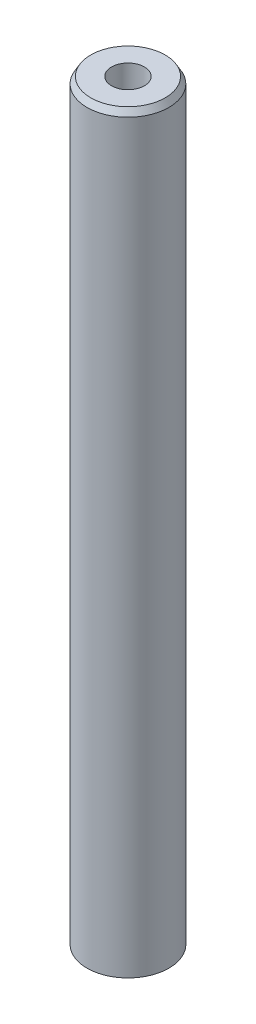
ISO-10303-21;
HEADER;
FILE_DESCRIPTION(('STEP AP214'),'2;1');
FILE_NAME('part.step','',(''),(''),'','','');
FILE_SCHEMA(('AUTOMOTIVE_DESIGN { 1 0 10303 214 1 1 1 1 }'));
ENDSEC;
DATA;
#1=APPLICATION_CONTEXT('core data for automotive mechanical design processes');
#2=APPLICATION_PROTOCOL_DEFINITION('international standard','automotive_design',2000,#1);
#3=PRODUCT_CONTEXT('',#1,'mechanical');
#4=PRODUCT('Part','Part','',(#3));
#5=PRODUCT_RELATED_PRODUCT_CATEGORY('part','',(#4));
#6=PRODUCT_DEFINITION_FORMATION('','',#4);
#7=PRODUCT_DEFINITION_CONTEXT('part definition',#1,'design');
#8=PRODUCT_DEFINITION('design','',#6,#7);
#9=PRODUCT_DEFINITION_SHAPE('','',#8);
#10=(LENGTH_UNIT() NAMED_UNIT(*) SI_UNIT(.MILLI.,.METRE.));
#11=(NAMED_UNIT(*) PLANE_ANGLE_UNIT() SI_UNIT($,.RADIAN.));
#12=(NAMED_UNIT(*) SI_UNIT($,.STERADIAN.) SOLID_ANGLE_UNIT());
#13=UNCERTAINTY_MEASURE_WITH_UNIT(LENGTH_MEASURE(1.E-05),#10,'distance_accuracy_value','');
#14=(GEOMETRIC_REPRESENTATION_CONTEXT(3) GLOBAL_UNCERTAINTY_ASSIGNED_CONTEXT((#13)) GLOBAL_UNIT_ASSIGNED_CONTEXT((#10,
#11,#12)) REPRESENTATION_CONTEXT('',''));
#15=CARTESIAN_POINT('',(0.,0.,0.));
#16=DIRECTION('',(0.,0.,1.));
#17=DIRECTION('',(1.,0.,0.));
#18=AXIS2_PLACEMENT_3D('',#15,#16,#17);
#19=CARTESIAN_POINT('',(0.,600.,0.));
#20=DIRECTION('',(0.,-1.,0.));
#21=DIRECTION('',(0.,0.,-1.));
#22=AXIS2_PLACEMENT_3D('',#19,#20,#21);
#23=CYLINDRICAL_SURFACE('',#22,32.5);
#24=CARTESIAN_POINT('',(0.,594.861538662219,0.));
#25=DIRECTION('',(0.,1.,0.));
#26=DIRECTION('',(0.,0.,1.));
#27=AXIS2_PLACEMENT_3D('',#24,#25,#26);
#28=CIRCLE('',#27,32.5);
#29=CARTESIAN_POINT('',(0.,594.861538662219,32.5));
#30=VERTEX_POINT('',#29);
#31=EDGE_CURVE('E50',#30,#30,#28,.F.);
#32=ORIENTED_EDGE('',*,*,#31,.T.);
#33=EDGE_LOOP('',(#32));
#34=FACE_BOUND('',#33,.T.);
#35=CARTESIAN_POINT('',(0.,2.96669203658828,0.));
#36=DIRECTION('',(0.,1.,0.));
#37=DIRECTION('',(0.,0.,1.));
#38=AXIS2_PLACEMENT_3D('',#35,#36,#37);
#39=CIRCLE('',#38,32.5);
#40=CARTESIAN_POINT('',(0.,2.96669203658828,32.5));
#41=VERTEX_POINT('',#40);
#42=EDGE_CURVE('E51',#41,#41,#39,.T.);
#43=ORIENTED_EDGE('',*,*,#42,.T.);
#44=EDGE_LOOP('',(#43));
#45=FACE_BOUND('',#44,.T.);
#46=ADVANCED_FACE('F39',(#34,#45),#23,.T.);
#47=CARTESIAN_POINT('',(0.,600.,0.));
#48=DIRECTION('',(0.,1.,0.));
#49=DIRECTION('',(0.,0.,1.));
#50=AXIS2_PLACEMENT_3D('',#47,#48,#49);
#51=PLANE('',#50);
#52=CARTESIAN_POINT('',(0.,600.,0.));
#53=DIRECTION('',(0.,1.,0.));
#54=DIRECTION('',(0.,0.,1.));
#55=AXIS2_PLACEMENT_3D('',#52,#53,#54);
#56=CIRCLE('',#55,29.5333079634116);
#57=CARTESIAN_POINT('',(0.,600.,29.5333079634116));
#58=VERTEX_POINT('',#57);
#59=EDGE_CURVE('E54',#58,#58,#56,.T.);
#60=ORIENTED_EDGE('',*,*,#59,.T.);
#61=EDGE_LOOP('',(#60));
#62=FACE_BOUND('',#61,.T.);
#63=CARTESIAN_POINT('',(0.,600.,0.));
#64=DIRECTION('',(0.,1.,0.));
#65=DIRECTION('',(0.,0.,1.));
#66=AXIS2_PLACEMENT_3D('',#63,#64,#65);
#67=CIRCLE('',#66,13.0247860554723);
#68=CARTESIAN_POINT('',(0.,600.,13.0247860554723));
#69=VERTEX_POINT('',#68);
#70=EDGE_CURVE('E58',#69,#69,#67,.T.);
#71=ORIENTED_EDGE('',*,*,#70,.F.);
#72=EDGE_LOOP('',(#71));
#73=FACE_BOUND('',#72,.T.);
#74=ADVANCED_FACE('F69',(#62,#73),#51,.T.);
#75=CARTESIAN_POINT('',(0.,0.,0.));
#76=DIRECTION('',(0.,1.,0.));
#77=DIRECTION('',(0.,0.,1.));
#78=AXIS2_PLACEMENT_3D('',#75,#76,#77);
#79=PLANE('',#78);
#80=CARTESIAN_POINT('',(0.,0.,0.));
#81=DIRECTION('',(0.,1.,0.));
#82=DIRECTION('',(0.,0.,1.));
#83=AXIS2_PLACEMENT_3D('',#80,#81,#82);
#84=CIRCLE('',#83,27.361538662219);
#85=CARTESIAN_POINT('',(0.,0.,27.361538662219));
#86=VERTEX_POINT('',#85);
#87=EDGE_CURVE('E10',#86,#86,#84,.F.);
#88=ORIENTED_EDGE('',*,*,#87,.T.);
#89=EDGE_LOOP('',(#88));
#90=FACE_BOUND('',#89,.T.);
#91=CARTESIAN_POINT('',(0.,0.,0.));
#92=DIRECTION('',(0.,1.,0.));
#93=DIRECTION('',(0.,0.,1.));
#94=AXIS2_PLACEMENT_3D('',#91,#92,#93);
#95=CIRCLE('',#94,13.0247860554723);
#96=CARTESIAN_POINT('',(0.,0.,13.0247860554723));
#97=VERTEX_POINT('',#96);
#98=EDGE_CURVE('E63',#97,#97,#95,.T.);
#99=ORIENTED_EDGE('',*,*,#98,.T.);
#100=EDGE_LOOP('',(#99));
#101=FACE_BOUND('',#100,.T.);
#102=ADVANCED_FACE('F75',(#90,#101),#79,.F.);
#103=CARTESIAN_POINT('',(0.,600.,0.));
#104=DIRECTION('',(0.,-1.,0.));
#105=DIRECTION('',(0.,0.,-1.));
#106=AXIS2_PLACEMENT_3D('',#103,#104,#105);
#107=CYLINDRICAL_SURFACE('',#106,13.0247860554723);
#108=ORIENTED_EDGE('',*,*,#70,.T.);
#109=EDGE_LOOP('',(#108));
#110=FACE_BOUND('',#109,.T.);
#111=ORIENTED_EDGE('',*,*,#98,.F.);
#112=EDGE_LOOP('',(#111));
#113=FACE_BOUND('',#112,.T.);
#114=ADVANCED_FACE('F70',(#110,#113),#107,.F.);
#115=CARTESIAN_POINT('',(0.,600.,0.));
#116=DIRECTION('',(0.,-1.,0.));
#117=DIRECTION('',(0.,0.,-1.));
#118=AXIS2_PLACEMENT_3D('',#115,#116,#117);
#119=CONICAL_SURFACE('',#118,29.5333079634116,0.523598775598296);
#120=ORIENTED_EDGE('',*,*,#31,.F.);
#121=EDGE_LOOP('',(#120));
#122=FACE_BOUND('',#121,.T.);
#123=ORIENTED_EDGE('',*,*,#59,.F.);
#124=EDGE_LOOP('',(#123));
#125=FACE_BOUND('',#124,.T.);
#126=ADVANCED_FACE('F81',(#122,#125),#119,.T.);
#127=CARTESIAN_POINT('',(0.,2.96669203658828,0.));
#128=DIRECTION('',(0.,1.,0.));
#129=DIRECTION('',(0.,0.,1.));
#130=AXIS2_PLACEMENT_3D('',#127,#128,#129);
#131=CONICAL_SURFACE('',#130,32.5,1.04719755119661);
#132=CARTESIAN_POINT('',(0.,0.,27.361538662219));
#133=CARTESIAN_POINT('',(0.,0.0309030420477941,27.4150643011542));
#134=CARTESIAN_POINT('',(0.,0.0618060840955887,27.4685899400895));
#135=CARTESIAN_POINT('',(0.,0.123612168191178,27.5756412179599));
#136=CARTESIAN_POINT('',(0.,0.154515210238973,27.6291668568951));
#137=CARTESIAN_POINT('',(0.,0.216321294334562,27.7362181347656));
#138=CARTESIAN_POINT('',(0.,0.247224336382356,27.7897437737008));
#139=CARTESIAN_POINT('',(0.,0.309030420477946,27.8967950515712));
#140=CARTESIAN_POINT('',(0.,0.33993346252574,27.9503206905064));
#141=CARTESIAN_POINT('',(0.,0.401739546621329,28.0573719683769));
#142=CARTESIAN_POINT('',(0.,0.432642588669124,28.1108976073121));
#143=CARTESIAN_POINT('',(0.,0.494448672764713,28.2179488851825));
#144=CARTESIAN_POINT('',(0.,0.525351714812507,28.2714745241177));
#145=CARTESIAN_POINT('',(0.,0.587157798908097,28.3785258019882));
#146=CARTESIAN_POINT('',(0.,0.618060840955892,28.4320514409234));
#147=CARTESIAN_POINT('',(0.,0.679866925051481,28.5391027187938));
#148=CARTESIAN_POINT('',(0.,0.710769967099275,28.592628357729));
#149=CARTESIAN_POINT('',(0.,0.772576051194864,28.6996796355995));
#150=CARTESIAN_POINT('',(0.,0.803479093242659,28.7532052745347));
#151=CARTESIAN_POINT('',(0.,0.865285177338248,28.8602565524051));
#152=CARTESIAN_POINT('',(0.,0.896188219386043,28.9137821913404));
#153=CARTESIAN_POINT('',(0.,0.957994303481632,29.0208334692108));
#154=CARTESIAN_POINT('',(0.,0.988897345529427,29.074359108146));
#155=CARTESIAN_POINT('',(0.,1.05070342962502,29.1814103860164));
#156=CARTESIAN_POINT('',(0.,1.08160647167281,29.2349360249517));
#157=CARTESIAN_POINT('',(0.,1.1434125557684,29.3419873028221));
#158=CARTESIAN_POINT('',(0.,1.17431559781619,29.3955129417573));
#159=CARTESIAN_POINT('',(0.,1.23612168191178,29.5025642196278));
#160=CARTESIAN_POINT('',(0.,1.26702472395958,29.556089858563));
#161=CARTESIAN_POINT('',(0.,1.32883080805517,29.6631411364334));
#162=CARTESIAN_POINT('',(0.,1.35973385010296,29.7166667753686));
#163=CARTESIAN_POINT('',(0.,1.42153993419855,29.8237180532391));
#164=CARTESIAN_POINT('',(0.,1.45244297624635,29.8772436921743));
#165=CARTESIAN_POINT('',(0.,1.51424906034193,29.9842949700447));
#166=CARTESIAN_POINT('',(0.,1.54515210238973,30.0378206089799));
#167=CARTESIAN_POINT('',(0.,1.60695818648532,30.1448718868504));
#168=CARTESIAN_POINT('',(0.,1.63786122853311,30.1983975257856));
#169=CARTESIAN_POINT('',(0.,1.6996673126287,30.305448803656));
#170=CARTESIAN_POINT('',(0.,1.7305703546765,30.3589744425913));
#171=CARTESIAN_POINT('',(0.,1.79237643877209,30.4660257204617));
#172=CARTESIAN_POINT('',(0.,1.82327948081988,30.5195513593969));
#173=CARTESIAN_POINT('',(0.,1.88508556491547,30.6266026372674));
#174=CARTESIAN_POINT('',(0.,1.91598860696326,30.6801282762026));
#175=CARTESIAN_POINT('',(0.,1.97779469105885,30.787179554073));
#176=CARTESIAN_POINT('',(0.,2.00869773310665,30.8407051930082));
#177=CARTESIAN_POINT('',(0.,2.07050381720224,30.9477564708787));
#178=CARTESIAN_POINT('',(0.,2.10140685925003,31.0012821098139));
#179=CARTESIAN_POINT('',(0.,2.16321294334562,31.1083333876843));
#180=CARTESIAN_POINT('',(0.,2.19411598539342,31.1618590266195));
#181=CARTESIAN_POINT('',(0.,2.255922069489,31.26891030449));
#182=CARTESIAN_POINT('',(0.,2.2868251115368,31.3224359434252));
#183=CARTESIAN_POINT('',(0.,2.34863119563239,31.4294872212956));
#184=CARTESIAN_POINT('',(0.,2.37953423768018,31.4830128602309));
#185=CARTESIAN_POINT('',(0.,2.44134032177577,31.5900641381013));
#186=CARTESIAN_POINT('',(0.,2.47224336382357,31.6435897770365));
#187=CARTESIAN_POINT('',(0.,2.53404944791916,31.7506410549069));
#188=CARTESIAN_POINT('',(0.,2.56495248996695,31.8041666938422));
#189=CARTESIAN_POINT('',(0.,2.62675857406254,31.9112179717126));
#190=CARTESIAN_POINT('',(0.,2.65766161611033,31.9647436106478));
#191=CARTESIAN_POINT('',(0.,2.71946770020592,32.0717948885183));
#192=CARTESIAN_POINT('',(0.,2.75037074225372,32.1253205274535));
#193=CARTESIAN_POINT('',(0.,2.81217682634931,32.2323718053239));
#194=CARTESIAN_POINT('',(0.,2.8430798683971,32.2858974442591));
#195=CARTESIAN_POINT('',(0.,2.90488595249269,32.3929487221296));
#196=CARTESIAN_POINT('',(0.,2.93578899454049,32.4464743610648));
#197=CARTESIAN_POINT('',(0.,2.96669203658828,32.5));
#198=B_SPLINE_CURVE_WITH_KNOTS('',3,(#132,#133,#134,#135,#136,#137,#138,#139,#140,#141,#142,
#143,#144,#145,#146,#147,#148,#149,#150,#151,#152,#153,#154,#155,#156,#157,#158,#159,#160,#161,
#162,#163,#164,#165,#166,#167,#168,#169,#170,#171,#172,#173,#174,#175,#176,#177,#178,#179,#180,
#181,#182,#183,#184,#185,#186,#187,#188,#189,#190,#191,#192,#193,#194,#195,#196,#197),
.UNSPECIFIED.,.F.,.F.,(4,2,2,2,2,2,2,2,2,2,2,2,2,2,2,2,2,2,2,2,2,2,2,2,2,2,2,2,2,2,2,2,4),(0.,
0.185418252286769,0.370836504573539,0.556254756860308,0.741673009147077,0.927091261433849,
1.11250951372062,1.29792776600739,1.48334601829416,1.66876427058093,1.8541825228677,
2.03960077515447,2.22501902744124,2.41043727972801,2.59585553201478,2.78127378430155,
2.96669203658832,3.15211028887509,3.33752854116186,3.52294679344863,3.7083650457354,
3.89378329802217,4.07920155030894,4.26461980259571,4.45003805488248,4.63545630716925,
4.82087455945602,5.00629281174279,5.19171106402956,5.37712931631633,5.5625475686031,
5.74796582088987,5.93338407317664),.UNSPECIFIED.);
#199=EDGE_CURVE('BSEAM45',#86,#41,#198,.T.);
#200=ORIENTED_EDGE('',*,*,#87,.F.);
#201=ORIENTED_EDGE('',*,*,#42,.F.);
#202=ORIENTED_EDGE('',*,*,#199,.T.);
#203=ORIENTED_EDGE('',*,*,#199,.F.);
#204=EDGE_LOOP('',(#200,#202,#201,#203));
#205=FACE_BOUND('',#204,.T.);
#206=ADVANCED_FACE('F45',(#205),#131,.T.);
#207=CLOSED_SHELL('',(#46,#74,#102,#114,#126,#206));
#208=MANIFOLD_SOLID_BREP('B2',#207);
#209=ADVANCED_BREP_SHAPE_REPRESENTATION('',(#18,#208),#14);
#210=SHAPE_DEFINITION_REPRESENTATION(#9,#209);
ENDSEC;
END-ISO-10303-21;
